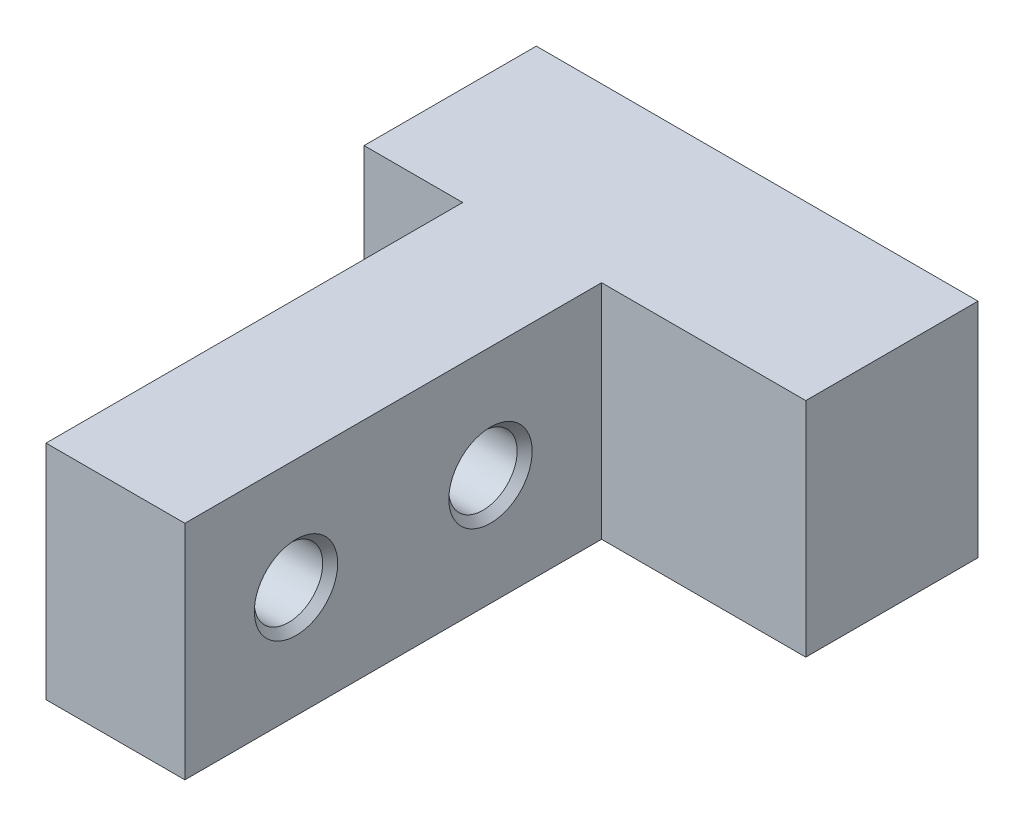
ISO-10303-21;
HEADER;
FILE_DESCRIPTION(('STEP AP214'),'2;1');
FILE_NAME('part.step','',(''),(''),'','','');
FILE_SCHEMA(('AUTOMOTIVE_DESIGN { 1 0 10303 214 1 1 1 1 }'));
ENDSEC;
DATA;
#1=APPLICATION_CONTEXT('core data for automotive mechanical design processes');
#2=APPLICATION_PROTOCOL_DEFINITION('international standard','automotive_design',2000,#1);
#3=PRODUCT_CONTEXT('',#1,'mechanical');
#4=PRODUCT('Part','Part','',(#3));
#5=PRODUCT_RELATED_PRODUCT_CATEGORY('part','',(#4));
#6=PRODUCT_DEFINITION_FORMATION('','',#4);
#7=PRODUCT_DEFINITION_CONTEXT('part definition',#1,'design');
#8=PRODUCT_DEFINITION('design','',#6,#7);
#9=PRODUCT_DEFINITION_SHAPE('','',#8);
#10=(LENGTH_UNIT() NAMED_UNIT(*) SI_UNIT(.MILLI.,.METRE.));
#11=(NAMED_UNIT(*) PLANE_ANGLE_UNIT() SI_UNIT($,.RADIAN.));
#12=(NAMED_UNIT(*) SI_UNIT($,.STERADIAN.) SOLID_ANGLE_UNIT());
#13=UNCERTAINTY_MEASURE_WITH_UNIT(LENGTH_MEASURE(1.E-05),#10,'distance_accuracy_value','');
#14=(GEOMETRIC_REPRESENTATION_CONTEXT(3) GLOBAL_UNCERTAINTY_ASSIGNED_CONTEXT((#13)) GLOBAL_UNIT_ASSIGNED_CONTEXT((#10,
#11,#12)) REPRESENTATION_CONTEXT('',''));
#15=CARTESIAN_POINT('',(0.,0.,0.));
#16=DIRECTION('',(0.,0.,1.));
#17=DIRECTION('',(1.,0.,0.));
#18=AXIS2_PLACEMENT_3D('',#15,#16,#17);
#19=CARTESIAN_POINT('',(-9.95,0.,6.3));
#20=DIRECTION('',(-1.,0.,0.));
#21=DIRECTION('',(0.,0.,1.));
#22=AXIS2_PLACEMENT_3D('',#19,#20,#21);
#23=CYLINDRICAL_SURFACE('',#22,1.23000000000001);
#24=CARTESIAN_POINT('',(-12.1799999999439,0.,6.3));
#25=DIRECTION('',(-1.,0.,0.));
#26=DIRECTION('',(0.,0.,1.));
#27=AXIS2_PLACEMENT_3D('',#24,#25,#26);
#28=CIRCLE('',#27,1.22999999997428);
#29=CARTESIAN_POINT('',(-12.1799999999439,0.,7.52999999997428));
#30=VERTEX_POINT('',#29);
#31=EDGE_CURVE('E125',#30,#30,#28,.T.);
#32=ORIENTED_EDGE('',*,*,#31,.T.);
#33=EDGE_LOOP('',(#32));
#34=FACE_BOUND('',#33,.T.);
#35=CARTESIAN_POINT('',(-7.72000000006301,0.,6.3));
#36=DIRECTION('',(1.,0.,0.));
#37=DIRECTION('',(0.,0.,1.));
#38=AXIS2_PLACEMENT_3D('',#35,#36,#37);
#39=CIRCLE('',#38,1.22999999997428);
#40=CARTESIAN_POINT('',(-7.72000000006301,0.,7.52999999997428));
#41=VERTEX_POINT('',#40);
#42=EDGE_CURVE('E119',#41,#41,#39,.T.);
#43=ORIENTED_EDGE('',*,*,#42,.T.);
#44=EDGE_LOOP('',(#43));
#45=FACE_BOUND('',#44,.T.);
#46=ADVANCED_FACE('F17',(#34,#45),#23,.F.);
#47=CARTESIAN_POINT('',(-9.95,0.,13.3));
#48=DIRECTION('',(-1.,0.,0.));
#49=DIRECTION('',(0.,0.,1.));
#50=AXIS2_PLACEMENT_3D('',#47,#48,#49);
#51=CYLINDRICAL_SURFACE('',#50,1.23000000000001);
#52=CARTESIAN_POINT('',(-12.1800000000007,0.,13.3));
#53=DIRECTION('',(-1.,0.,0.));
#54=DIRECTION('',(0.,0.,1.));
#55=AXIS2_PLACEMENT_3D('',#52,#53,#54);
#56=CIRCLE('',#55,1.22999999997928);
#57=CARTESIAN_POINT('',(-12.1800000000007,0.,14.5299999999793));
#58=VERTEX_POINT('',#57);
#59=EDGE_CURVE('E122',#58,#58,#56,.T.);
#60=ORIENTED_EDGE('',*,*,#59,.T.);
#61=EDGE_LOOP('',(#60));
#62=FACE_BOUND('',#61,.T.);
#63=CARTESIAN_POINT('',(-7.72000000000617,0.,13.3));
#64=DIRECTION('',(1.,0.,0.));
#65=DIRECTION('',(0.,0.,1.));
#66=AXIS2_PLACEMENT_3D('',#63,#64,#65);
#67=CIRCLE('',#66,1.23000000003612);
#68=CARTESIAN_POINT('',(-7.72000000000617,0.,14.5300000000361));
#69=VERTEX_POINT('',#68);
#70=EDGE_CURVE('E116',#69,#69,#67,.T.);
#71=ORIENTED_EDGE('',*,*,#70,.T.);
#72=EDGE_LOOP('',(#71));
#73=FACE_BOUND('',#72,.T.);
#74=ADVANCED_FACE('F138',(#62,#73),#51,.F.);
#75=CARTESIAN_POINT('',(-12.4499999999443,0.,6.3));
#76=DIRECTION('',(-1.,0.,0.));
#77=DIRECTION('',(0.,0.,1.));
#78=AXIS2_PLACEMENT_3D('',#75,#76,#77);
#79=CONICAL_SURFACE('',#78,1.49999999997472,0.785398163502714);
#80=ORIENTED_EDGE('',*,*,#31,.F.);
#81=EDGE_LOOP('',(#80));
#82=FACE_BOUND('',#81,.T.);
#83=CARTESIAN_POINT('',(-12.4499999999342,0.,6.3));
#84=DIRECTION('',(-1.,0.,0.));
#85=DIRECTION('',(0.,0.,1.));
#86=AXIS2_PLACEMENT_3D('',#83,#84,#85);
#87=CIRCLE('',#86,1.49999999996453);
#88=CARTESIAN_POINT('',(-12.4499999999342,0.,7.79999999996453));
#89=VERTEX_POINT('',#88);
#90=EDGE_CURVE('E20',#89,#89,#87,.F.);
#91=ORIENTED_EDGE('',*,*,#90,.F.);
#92=EDGE_LOOP('',(#91));
#93=FACE_BOUND('',#92,.T.);
#94=ADVANCED_FACE('F135',(#82,#93),#79,.F.);
#95=CARTESIAN_POINT('',(-12.4500000001149,0.,13.3));
#96=DIRECTION('',(-1.,0.,0.));
#97=DIRECTION('',(0.,0.,1.));
#98=AXIS2_PLACEMENT_3D('',#95,#96,#97);
#99=CONICAL_SURFACE('',#98,1.5000000000934,0.785398163397448);
#100=ORIENTED_EDGE('',*,*,#59,.F.);
#101=EDGE_LOOP('',(#100));
#102=FACE_BOUND('',#101,.T.);
#103=CARTESIAN_POINT('',(-12.450000000058,0.,13.3));
#104=DIRECTION('',(-1.,0.,0.));
#105=DIRECTION('',(0.,0.,1.));
#106=AXIS2_PLACEMENT_3D('',#103,#104,#105);
#107=CIRCLE('',#106,1.50000000003656);
#108=CARTESIAN_POINT('',(-12.450000000058,0.,14.8000000000366));
#109=VERTEX_POINT('',#108);
#110=EDGE_CURVE('E102',#109,#109,#107,.F.);
#111=ORIENTED_EDGE('',*,*,#110,.F.);
#112=EDGE_LOOP('',(#111));
#113=FACE_BOUND('',#112,.T.);
#114=ADVANCED_FACE('F137',(#102,#113),#99,.F.);
#115=CARTESIAN_POINT('',(-7.44999999994889,0.,6.3));
#116=DIRECTION('',(1.,0.,0.));
#117=DIRECTION('',(0.,0.,-1.));
#118=AXIS2_PLACEMENT_3D('',#115,#116,#117);
#119=CONICAL_SURFACE('',#118,1.50000000003156,0.785398163292183);
#120=ORIENTED_EDGE('',*,*,#42,.F.);
#121=EDGE_LOOP('',(#120));
#122=FACE_BOUND('',#121,.T.);
#123=CARTESIAN_POINT('',(-7.44999999994889,0.,6.3));
#124=DIRECTION('',(1.,0.,0.));
#125=DIRECTION('',(0.,0.,-1.));
#126=AXIS2_PLACEMENT_3D('',#123,#124,#125);
#127=CIRCLE('',#126,1.50000000003156);
#128=CARTESIAN_POINT('',(-7.44999999994889,0.,4.79999999996844));
#129=VERTEX_POINT('',#128);
#130=EDGE_CURVE('E108',#129,#129,#127,.F.);
#131=ORIENTED_EDGE('',*,*,#130,.F.);
#132=EDGE_LOOP('',(#131));
#133=FACE_BOUND('',#132,.T.);
#134=ADVANCED_FACE('F146',(#122,#133),#119,.F.);
#135=CARTESIAN_POINT('',(-7.44999999994889,0.,13.3));
#136=DIRECTION('',(1.,0.,0.));
#137=DIRECTION('',(0.,0.,-1.));
#138=AXIS2_PLACEMENT_3D('',#135,#136,#137);
#139=CONICAL_SURFACE('',#138,1.5000000000934,0.785398163397448);
#140=ORIENTED_EDGE('',*,*,#70,.F.);
#141=EDGE_LOOP('',(#140));
#142=FACE_BOUND('',#141,.T.);
#143=CARTESIAN_POINT('',(-7.45000000000573,0.,13.3));
#144=DIRECTION('',(1.,0.,0.));
#145=DIRECTION('',(0.,0.,-1.));
#146=AXIS2_PLACEMENT_3D('',#143,#144,#145);
#147=CIRCLE('',#146,1.50000000003656);
#148=CARTESIAN_POINT('',(-7.45000000000573,0.,11.7999999999634));
#149=VERTEX_POINT('',#148);
#150=EDGE_CURVE('E111',#149,#149,#147,.F.);
#151=ORIENTED_EDGE('',*,*,#150,.F.);
#152=EDGE_LOOP('',(#151));
#153=FACE_BOUND('',#152,.T.);
#154=ADVANCED_FACE('F187',(#142,#153),#139,.F.);
#155=CARTESIAN_POINT('',(0.,4.,0.));
#156=DIRECTION('',(0.,1.,0.));
#157=DIRECTION('',(0.,0.,1.));
#158=AXIS2_PLACEMENT_3D('',#155,#156,#157);
#159=PLANE('',#158);
#160=DIRECTION('',(0.,0.,-1.));
#161=VECTOR('',#160,1.);
#162=CARTESIAN_POINT('',(-0.0999999999999996,4.,2.3));
#163=LINE('',#162,#161);
#164=CARTESIAN_POINT('',(-0.100000000000002,4.,-3.90000000000002));
#165=VERTEX_POINT('',#164);
#166=CARTESIAN_POINT('',(-0.0999999999999996,4.,2.29999999999999));
#167=VERTEX_POINT('',#166);
#168=EDGE_CURVE('E315',#165,#167,#163,.F.);
#169=ORIENTED_EDGE('',*,*,#168,.F.);
#170=DIRECTION('',(-1.,0.,0.));
#171=VECTOR('',#170,1.);
#172=CARTESIAN_POINT('',(-0.100000000000004,4.,-3.90000000000002));
#173=LINE('',#172,#171);
#174=CARTESIAN_POINT('',(-16.,4.,-3.90000000000001));
#175=VERTEX_POINT('',#174);
#176=EDGE_CURVE('E337',#175,#165,#173,.F.);
#177=ORIENTED_EDGE('',*,*,#176,.F.);
#178=DIRECTION('',(0.,0.,1.));
#179=VECTOR('',#178,1.);
#180=CARTESIAN_POINT('',(-16.,4.,-3.90000000000001));
#181=LINE('',#180,#179);
#182=CARTESIAN_POINT('',(-16.,4.,2.3));
#183=VERTEX_POINT('',#182);
#184=EDGE_CURVE('E333',#183,#175,#181,.F.);
#185=ORIENTED_EDGE('',*,*,#184,.F.);
#186=DIRECTION('',(1.,0.,0.));
#187=VECTOR('',#186,1.);
#188=CARTESIAN_POINT('',(-16.,4.,2.3));
#189=LINE('',#188,#187);
#190=CARTESIAN_POINT('',(-12.45,4.,2.3));
#191=VERTEX_POINT('',#190);
#192=EDGE_CURVE('E98',#191,#183,#189,.F.);
#193=ORIENTED_EDGE('',*,*,#192,.F.);
#194=DIRECTION('',(0.,0.,1.));
#195=VECTOR('',#194,1.);
#196=CARTESIAN_POINT('',(-12.45,4.,2.3));
#197=LINE('',#196,#195);
#198=CARTESIAN_POINT('',(-12.45,4.,17.3));
#199=VERTEX_POINT('',#198);
#200=EDGE_CURVE('E92',#199,#191,#197,.F.);
#201=ORIENTED_EDGE('',*,*,#200,.F.);
#202=DIRECTION('',(1.,0.,0.));
#203=VECTOR('',#202,1.);
#204=CARTESIAN_POINT('',(-12.45,4.,17.3));
#205=LINE('',#204,#203);
#206=CARTESIAN_POINT('',(-7.45,4.,17.3));
#207=VERTEX_POINT('',#206);
#208=EDGE_CURVE('E83',#207,#199,#205,.F.);
#209=ORIENTED_EDGE('',*,*,#208,.F.);
#210=DIRECTION('',(0.,0.,-1.));
#211=VECTOR('',#210,1.);
#212=CARTESIAN_POINT('',(-7.45,4.,17.3));
#213=LINE('',#212,#211);
#214=CARTESIAN_POINT('',(-7.45,4.,2.29999999999999));
#215=VERTEX_POINT('',#214);
#216=EDGE_CURVE('E78',#215,#207,#213,.F.);
#217=ORIENTED_EDGE('',*,*,#216,.F.);
#218=DIRECTION('',(1.,0.,0.));
#219=VECTOR('',#218,1.);
#220=CARTESIAN_POINT('',(-7.45,4.,2.29999999999999));
#221=LINE('',#220,#219);
#222=EDGE_CURVE('E306',#167,#215,#221,.F.);
#223=ORIENTED_EDGE('',*,*,#222,.F.);
#224=EDGE_LOOP('',(#169,#177,#185,#193,#201,#209,#217,#223));
#225=FACE_BOUND('',#224,.T.);
#226=ADVANCED_FACE('F96',(#225),#159,.T.);
#227=CARTESIAN_POINT('',(-12.45,4.,2.3));
#228=DIRECTION('',(-1.,0.,0.));
#229=DIRECTION('',(0.,0.,1.));
#230=AXIS2_PLACEMENT_3D('',#227,#228,#229);
#231=PLANE('',#230);
#232=ORIENTED_EDGE('',*,*,#200,.T.);
#233=DIRECTION('',(0.,1.,0.));
#234=VECTOR('',#233,1.);
#235=CARTESIAN_POINT('',(-12.45,4.,2.3));
#236=LINE('',#235,#234);
#237=CARTESIAN_POINT('',(-12.45,-4.,2.3));
#238=VERTEX_POINT('',#237);
#239=EDGE_CURVE('E329',#238,#191,#236,.T.);
#240=ORIENTED_EDGE('',*,*,#239,.F.);
#241=DIRECTION('',(0.,0.,1.));
#242=VECTOR('',#241,1.);
#243=CARTESIAN_POINT('',(-12.45,-4.,0.));
#244=LINE('',#243,#242);
#245=CARTESIAN_POINT('',(-12.45,-4.,17.3));
#246=VERTEX_POINT('',#245);
#247=EDGE_CURVE('E107',#238,#246,#244,.T.);
#248=ORIENTED_EDGE('',*,*,#247,.T.);
#249=DIRECTION('',(0.,1.,0.));
#250=VECTOR('',#249,1.);
#251=CARTESIAN_POINT('',(-12.45,4.,17.3));
#252=LINE('',#251,#250);
#253=EDGE_CURVE('E88',#199,#246,#252,.F.);
#254=ORIENTED_EDGE('',*,*,#253,.F.);
#255=EDGE_LOOP('',(#232,#240,#248,#254));
#256=FACE_BOUND('',#255,.T.);
#257=ORIENTED_EDGE('',*,*,#110,.T.);
#258=EDGE_LOOP('',(#257));
#259=FACE_BOUND('',#258,.T.);
#260=ORIENTED_EDGE('',*,*,#90,.T.);
#261=EDGE_LOOP('',(#260));
#262=FACE_BOUND('',#261,.T.);
#263=ADVANCED_FACE('F105',(#256,#259,#262),#231,.T.);
#264=CARTESIAN_POINT('',(-12.45,4.,17.3));
#265=DIRECTION('',(0.,0.,1.));
#266=DIRECTION('',(1.,0.,0.));
#267=AXIS2_PLACEMENT_3D('',#264,#265,#266);
#268=PLANE('',#267);
#269=ORIENTED_EDGE('',*,*,#208,.T.);
#270=ORIENTED_EDGE('',*,*,#253,.T.);
#271=DIRECTION('',(1.,0.,0.));
#272=VECTOR('',#271,1.);
#273=CARTESIAN_POINT('',(0.,-4.,17.3));
#274=LINE('',#273,#272);
#275=CARTESIAN_POINT('',(-7.45,-4.,17.3));
#276=VERTEX_POINT('',#275);
#277=EDGE_CURVE('E319',#246,#276,#274,.T.);
#278=ORIENTED_EDGE('',*,*,#277,.T.);
#279=DIRECTION('',(0.,1.,0.));
#280=VECTOR('',#279,1.);
#281=CARTESIAN_POINT('',(-7.45,4.,17.3));
#282=LINE('',#281,#280);
#283=EDGE_CURVE('E90',#207,#276,#282,.F.);
#284=ORIENTED_EDGE('',*,*,#283,.F.);
#285=EDGE_LOOP('',(#269,#270,#278,#284));
#286=FACE_BOUND('',#285,.T.);
#287=ADVANCED_FACE('F85',(#286),#268,.T.);
#288=CARTESIAN_POINT('',(-7.45,4.,17.3));
#289=DIRECTION('',(1.,0.,0.));
#290=DIRECTION('',(0.,0.,-1.));
#291=AXIS2_PLACEMENT_3D('',#288,#289,#290);
#292=PLANE('',#291);
#293=ORIENTED_EDGE('',*,*,#216,.T.);
#294=ORIENTED_EDGE('',*,*,#283,.T.);
#295=DIRECTION('',(0.,0.,1.));
#296=VECTOR('',#295,1.);
#297=CARTESIAN_POINT('',(-7.45,-4.,0.));
#298=LINE('',#297,#296);
#299=CARTESIAN_POINT('',(-7.45,-4.,2.29999999999999));
#300=VERTEX_POINT('',#299);
#301=EDGE_CURVE('E314',#276,#300,#298,.F.);
#302=ORIENTED_EDGE('',*,*,#301,.T.);
#303=DIRECTION('',(0.,1.,0.));
#304=VECTOR('',#303,1.);
#305=CARTESIAN_POINT('',(-7.45,4.,2.29999999999999));
#306=LINE('',#305,#304);
#307=EDGE_CURVE('E308',#215,#300,#306,.F.);
#308=ORIENTED_EDGE('',*,*,#307,.F.);
#309=EDGE_LOOP('',(#293,#294,#302,#308));
#310=FACE_BOUND('',#309,.T.);
#311=ORIENTED_EDGE('',*,*,#150,.T.);
#312=EDGE_LOOP('',(#311));
#313=FACE_BOUND('',#312,.T.);
#314=ORIENTED_EDGE('',*,*,#130,.T.);
#315=EDGE_LOOP('',(#314));
#316=FACE_BOUND('',#315,.T.);
#317=ADVANCED_FACE('F177',(#310,#313,#316),#292,.T.);
#318=CARTESIAN_POINT('',(-7.45,4.,2.29999999999999));
#319=DIRECTION('',(0.,0.,1.));
#320=DIRECTION('',(1.,0.,0.));
#321=AXIS2_PLACEMENT_3D('',#318,#319,#320);
#322=PLANE('',#321);
#323=ORIENTED_EDGE('',*,*,#222,.T.);
#324=ORIENTED_EDGE('',*,*,#307,.T.);
#325=DIRECTION('',(1.,0.,0.));
#326=VECTOR('',#325,1.);
#327=CARTESIAN_POINT('',(0.,-4.,2.29999999999999));
#328=LINE('',#327,#326);
#329=CARTESIAN_POINT('',(-0.0999999999999995,-4.,2.3));
#330=VERTEX_POINT('',#329);
#331=EDGE_CURVE('E321',#300,#330,#328,.T.);
#332=ORIENTED_EDGE('',*,*,#331,.T.);
#333=DIRECTION('',(0.,1.,0.));
#334=VECTOR('',#333,1.);
#335=CARTESIAN_POINT('',(-0.0999999999999996,4.,2.3));
#336=LINE('',#335,#334);
#337=EDGE_CURVE('E310',#167,#330,#336,.F.);
#338=ORIENTED_EDGE('',*,*,#337,.F.);
#339=EDGE_LOOP('',(#323,#324,#332,#338));
#340=FACE_BOUND('',#339,.T.);
#341=ADVANCED_FACE('F173',(#340),#322,.T.);
#342=CARTESIAN_POINT('',(-0.0999999999999996,4.,2.3));
#343=DIRECTION('',(1.,0.,0.));
#344=DIRECTION('',(0.,0.,-1.));
#345=AXIS2_PLACEMENT_3D('',#342,#343,#344);
#346=PLANE('',#345);
#347=ORIENTED_EDGE('',*,*,#168,.T.);
#348=ORIENTED_EDGE('',*,*,#337,.T.);
#349=DIRECTION('',(0.,0.,1.));
#350=VECTOR('',#349,1.);
#351=CARTESIAN_POINT('',(-0.0999999999999996,-4.,0.));
#352=LINE('',#351,#350);
#353=CARTESIAN_POINT('',(-0.100000000000003,-4.,-3.90000000000002));
#354=VERTEX_POINT('',#353);
#355=EDGE_CURVE('E340',#330,#354,#352,.F.);
#356=ORIENTED_EDGE('',*,*,#355,.T.);
#357=DIRECTION('',(0.,1.,0.));
#358=VECTOR('',#357,1.);
#359=CARTESIAN_POINT('',(-0.100000000000004,4.,-3.90000000000002));
#360=LINE('',#359,#358);
#361=EDGE_CURVE('E335',#165,#354,#360,.F.);
#362=ORIENTED_EDGE('',*,*,#361,.F.);
#363=EDGE_LOOP('',(#347,#348,#356,#362));
#364=FACE_BOUND('',#363,.T.);
#365=ADVANCED_FACE('F169',(#364),#346,.T.);
#366=CARTESIAN_POINT('',(-0.100000000000004,4.,-3.90000000000002));
#367=DIRECTION('',(0.,0.,-1.));
#368=DIRECTION('',(-1.,0.,0.));
#369=AXIS2_PLACEMENT_3D('',#366,#367,#368);
#370=PLANE('',#369);
#371=ORIENTED_EDGE('',*,*,#176,.T.);
#372=ORIENTED_EDGE('',*,*,#361,.T.);
#373=DIRECTION('',(1.,0.,0.));
#374=VECTOR('',#373,1.);
#375=CARTESIAN_POINT('',(0.,-4.,-3.90000000000002));
#376=LINE('',#375,#374);
#377=CARTESIAN_POINT('',(-16.,-4.,-3.90000000000001));
#378=VERTEX_POINT('',#377);
#379=EDGE_CURVE('E343',#354,#378,#376,.F.);
#380=ORIENTED_EDGE('',*,*,#379,.T.);
#381=DIRECTION('',(0.,1.,0.));
#382=VECTOR('',#381,1.);
#383=CARTESIAN_POINT('',(-16.,4.,-3.90000000000001));
#384=LINE('',#383,#382);
#385=EDGE_CURVE('E331',#175,#378,#384,.F.);
#386=ORIENTED_EDGE('',*,*,#385,.F.);
#387=EDGE_LOOP('',(#371,#372,#380,#386));
#388=FACE_BOUND('',#387,.T.);
#389=ADVANCED_FACE('F165',(#388),#370,.T.);
#390=CARTESIAN_POINT('',(-16.,4.,-3.90000000000001));
#391=DIRECTION('',(-1.,0.,0.));
#392=DIRECTION('',(0.,0.,1.));
#393=AXIS2_PLACEMENT_3D('',#390,#391,#392);
#394=PLANE('',#393);
#395=ORIENTED_EDGE('',*,*,#184,.T.);
#396=ORIENTED_EDGE('',*,*,#385,.T.);
#397=DIRECTION('',(0.,0.,1.));
#398=VECTOR('',#397,1.);
#399=CARTESIAN_POINT('',(-16.,-4.,0.));
#400=LINE('',#399,#398);
#401=CARTESIAN_POINT('',(-16.,-4.,2.3));
#402=VERTEX_POINT('',#401);
#403=EDGE_CURVE('E26',#378,#402,#400,.T.);
#404=ORIENTED_EDGE('',*,*,#403,.T.);
#405=DIRECTION('',(0.,1.,0.));
#406=VECTOR('',#405,1.);
#407=CARTESIAN_POINT('',(-16.,4.,2.3));
#408=LINE('',#407,#406);
#409=EDGE_CURVE('E34',#183,#402,#408,.F.);
#410=ORIENTED_EDGE('',*,*,#409,.F.);
#411=EDGE_LOOP('',(#395,#396,#404,#410));
#412=FACE_BOUND('',#411,.T.);
#413=ADVANCED_FACE('F159',(#412),#394,.T.);
#414=CARTESIAN_POINT('',(-16.,4.,2.3));
#415=DIRECTION('',(0.,0.,1.));
#416=DIRECTION('',(1.,0.,0.));
#417=AXIS2_PLACEMENT_3D('',#414,#415,#416);
#418=PLANE('',#417);
#419=ORIENTED_EDGE('',*,*,#192,.T.);
#420=ORIENTED_EDGE('',*,*,#409,.T.);
#421=DIRECTION('',(1.,0.,0.));
#422=VECTOR('',#421,1.);
#423=CARTESIAN_POINT('',(0.,-4.,2.3));
#424=LINE('',#423,#422);
#425=EDGE_CURVE('E11',#402,#238,#424,.T.);
#426=ORIENTED_EDGE('',*,*,#425,.T.);
#427=ORIENTED_EDGE('',*,*,#239,.T.);
#428=EDGE_LOOP('',(#419,#420,#426,#427));
#429=FACE_BOUND('',#428,.T.);
#430=ADVANCED_FACE('F153',(#429),#418,.T.);
#431=CARTESIAN_POINT('',(0.,-4.,0.));
#432=DIRECTION('',(0.,1.,0.));
#433=DIRECTION('',(0.,0.,1.));
#434=AXIS2_PLACEMENT_3D('',#431,#432,#433);
#435=PLANE('',#434);
#436=ORIENTED_EDGE('',*,*,#403,.F.);
#437=ORIENTED_EDGE('',*,*,#379,.F.);
#438=ORIENTED_EDGE('',*,*,#355,.F.);
#439=ORIENTED_EDGE('',*,*,#331,.F.);
#440=ORIENTED_EDGE('',*,*,#301,.F.);
#441=ORIENTED_EDGE('',*,*,#277,.F.);
#442=ORIENTED_EDGE('',*,*,#247,.F.);
#443=ORIENTED_EDGE('',*,*,#425,.F.);
#444=EDGE_LOOP('',(#436,#437,#438,#439,#440,#441,#442,#443));
#445=FACE_BOUND('',#444,.T.);
#446=ADVANCED_FACE('F151',(#445),#435,.F.);
#447=CLOSED_SHELL('',(#46,#74,#94,#114,#134,#154,#226,#263,#287,#317,#341,#365,#389,#413,#430,#446));
#448=MANIFOLD_SOLID_BREP('B1',#447);
#449=ADVANCED_BREP_SHAPE_REPRESENTATION('',(#18,#448),#14);
#450=SHAPE_DEFINITION_REPRESENTATION(#9,#449);
ENDSEC;
END-ISO-10303-21;
